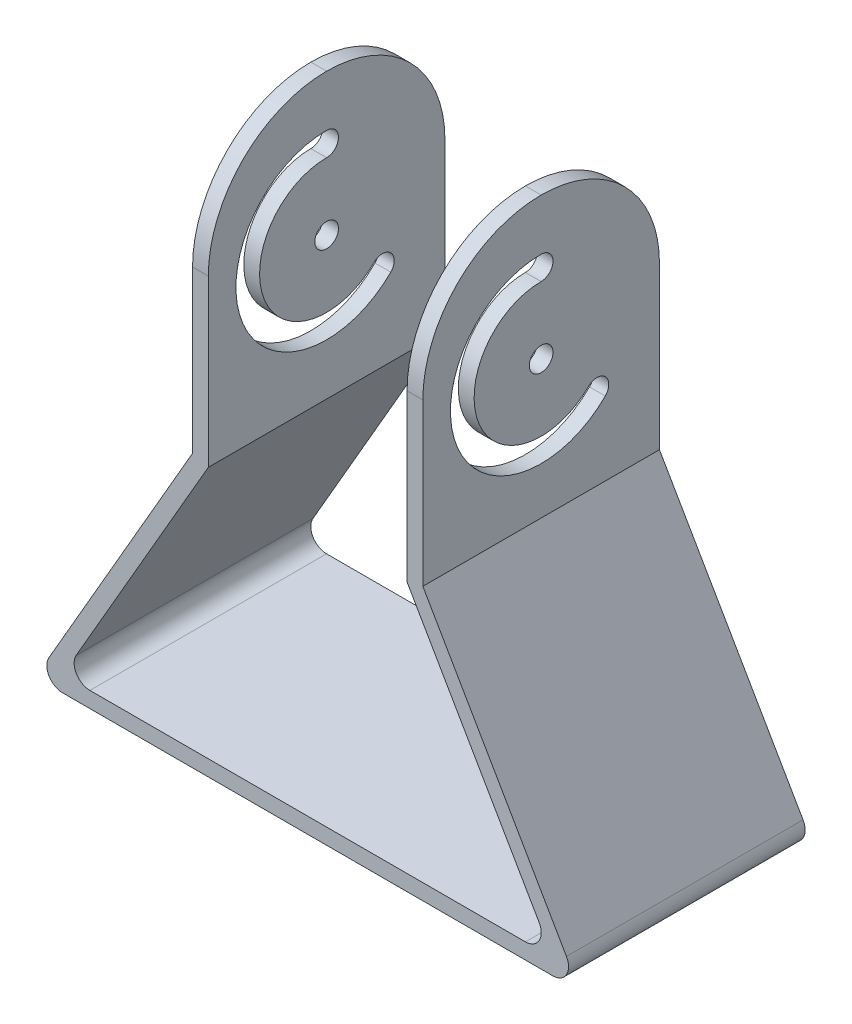
ISO-10303-21;
HEADER;
FILE_DESCRIPTION(('STEP AP214'),'2;1');
FILE_NAME('part.step','',(''),(''),'','','');
FILE_SCHEMA(('AUTOMOTIVE_DESIGN { 1 0 10303 214 1 1 1 1 }'));
ENDSEC;
DATA;
#1=APPLICATION_CONTEXT('core data for automotive mechanical design processes');
#2=APPLICATION_PROTOCOL_DEFINITION('international standard','automotive_design',2000,#1);
#3=PRODUCT_CONTEXT('',#1,'mechanical');
#4=PRODUCT('Part','Part','',(#3));
#5=PRODUCT_RELATED_PRODUCT_CATEGORY('part','',(#4));
#6=PRODUCT_DEFINITION_FORMATION('','',#4);
#7=PRODUCT_DEFINITION_CONTEXT('part definition',#1,'design');
#8=PRODUCT_DEFINITION('design','',#6,#7);
#9=PRODUCT_DEFINITION_SHAPE('','',#8);
#10=(LENGTH_UNIT() NAMED_UNIT(*) SI_UNIT(.MILLI.,.METRE.));
#11=(NAMED_UNIT(*) PLANE_ANGLE_UNIT() SI_UNIT($,.RADIAN.));
#12=(NAMED_UNIT(*) SI_UNIT($,.STERADIAN.) SOLID_ANGLE_UNIT());
#13=UNCERTAINTY_MEASURE_WITH_UNIT(LENGTH_MEASURE(1.E-05),#10,'distance_accuracy_value','');
#14=(GEOMETRIC_REPRESENTATION_CONTEXT(3) GLOBAL_UNCERTAINTY_ASSIGNED_CONTEXT((#13)) GLOBAL_UNIT_ASSIGNED_CONTEXT((#10,
#11,#12)) REPRESENTATION_CONTEXT('',''));
#15=CARTESIAN_POINT('',(0.,0.,0.));
#16=DIRECTION('',(0.,0.,1.));
#17=DIRECTION('',(1.,0.,0.));
#18=AXIS2_PLACEMENT_3D('',#15,#16,#17);
#19=CARTESIAN_POINT('',(-245.696551146028,350.,150.));
#20=DIRECTION('',(1.,0.,0.));
#21=DIRECTION('',(0.,1.,0.));
#22=AXIS2_PLACEMENT_3D('',#19,#20,#21);
#23=PLANE('',#22);
#24=CARTESIAN_POINT('',(-245.696551146028,260.,75.));
#25=DIRECTION('',(-1.,0.,0.));
#26=DIRECTION('',(0.,-1.,0.));
#27=AXIS2_PLACEMENT_3D('',#24,#25,#26);
#28=CIRCLE('',#27,57.5);
#29=CARTESIAN_POINT('',(-245.696551146028,219.341360081774,34.3413600817733));
#30=VERTEX_POINT('',#29);
#31=CARTESIAN_POINT('',(-245.696551146028,317.5,75.0000000000002));
#32=VERTEX_POINT('',#31);
#33=EDGE_CURVE('E246',#30,#32,#28,.T.);
#34=ORIENTED_EDGE('',*,*,#33,.F.);
#35=CARTESIAN_POINT('',(-245.696551146028,224.644660940673,39.6446609406724));
#36=DIRECTION('',(-1.,0.,0.));
#37=DIRECTION('',(0.,-1.,0.));
#38=AXIS2_PLACEMENT_3D('',#35,#36,#37);
#39=CIRCLE('',#38,7.5);
#40=CARTESIAN_POINT('',(-245.696551146028,229.947961799572,44.9479617995716));
#41=VERTEX_POINT('',#40);
#42=EDGE_CURVE('E221',#41,#30,#39,.T.);
#43=ORIENTED_EDGE('',*,*,#42,.F.);
#44=CARTESIAN_POINT('',(-245.696551146028,260.,75.));
#45=DIRECTION('',(1.,0.,0.));
#46=DIRECTION('',(0.,-1.,0.));
#47=AXIS2_PLACEMENT_3D('',#44,#45,#46);
#48=CIRCLE('',#47,42.5);
#49=CARTESIAN_POINT('',(-245.696551146028,302.5,75.0000000000002));
#50=VERTEX_POINT('',#49);
#51=EDGE_CURVE('E232',#50,#41,#48,.T.);
#52=ORIENTED_EDGE('',*,*,#51,.F.);
#53=CARTESIAN_POINT('',(-245.696551146028,310.,75.0000000000002));
#54=DIRECTION('',(-1.,0.,0.));
#55=DIRECTION('',(0.,-1.,0.));
#56=AXIS2_PLACEMENT_3D('',#53,#54,#55);
#57=CIRCLE('',#56,7.50000000000001);
#58=EDGE_CURVE('E240',#32,#50,#57,.T.);
#59=ORIENTED_EDGE('',*,*,#58,.F.);
#60=EDGE_LOOP('',(#34,#43,#52,#59));
#61=FACE_BOUND('',#60,.T.);
#62=CARTESIAN_POINT('',(-245.696551146028,260.,75.));
#63=DIRECTION('',(-1.,0.,0.));
#64=DIRECTION('',(0.,-1.,0.));
#65=AXIS2_PLACEMENT_3D('',#62,#63,#64);
#66=CIRCLE('',#65,7.50000000000003);
#67=CARTESIAN_POINT('',(-245.696551146028,252.5,75.));
#68=VERTEX_POINT('',#67);
#69=EDGE_CURVE('E248',#68,#68,#66,.T.);
#70=ORIENTED_EDGE('',*,*,#69,.F.);
#71=EDGE_LOOP('',(#70));
#72=FACE_BOUND('',#71,.T.);
#73=DIRECTION('',(0.,-1.,0.));
#74=VECTOR('',#73,1.);
#75=CARTESIAN_POINT('',(-245.696551146028,350.,150.));
#76=LINE('',#75,#74);
#77=CARTESIAN_POINT('',(-245.696551146028,275.,150.));
#78=VERTEX_POINT('',#77);
#79=CARTESIAN_POINT('',(-245.696551146028,172.679491924311,150.));
#80=VERTEX_POINT('',#79);
#81=EDGE_CURVE('E299',#78,#80,#76,.T.);
#82=ORIENTED_EDGE('',*,*,#81,.F.);
#83=CARTESIAN_POINT('',(-245.696551146028,275.,75.));
#84=DIRECTION('',(1.,0.,0.));
#85=DIRECTION('',(0.,1.,0.));
#86=AXIS2_PLACEMENT_3D('',#83,#84,#85);
#87=CIRCLE('',#86,75.);
#88=CARTESIAN_POINT('',(-245.696551146028,350.,75.));
#89=VERTEX_POINT('',#88);
#90=EDGE_CURVE('E428',#78,#89,#87,.F.);
#91=ORIENTED_EDGE('',*,*,#90,.T.);
#92=CARTESIAN_POINT('',(-245.696551146028,275.,75.));
#93=DIRECTION('',(1.,0.,0.));
#94=DIRECTION('',(0.,1.,0.));
#95=AXIS2_PLACEMENT_3D('',#92,#93,#94);
#96=CIRCLE('',#95,75.);
#97=CARTESIAN_POINT('',(-245.696551146028,275.,0.));
#98=VERTEX_POINT('',#97);
#99=EDGE_CURVE('E425',#89,#98,#96,.F.);
#100=ORIENTED_EDGE('',*,*,#99,.T.);
#101=DIRECTION('',(0.,-1.,0.));
#102=VECTOR('',#101,1.);
#103=CARTESIAN_POINT('',(-245.696551146028,350.,0.));
#104=LINE('',#103,#102);
#105=CARTESIAN_POINT('',(-245.696551146028,172.679491924311,0.));
#106=VERTEX_POINT('',#105);
#107=EDGE_CURVE('E298',#98,#106,#104,.T.);
#108=ORIENTED_EDGE('',*,*,#107,.T.);
#109=DIRECTION('',(0.,0.,-1.));
#110=VECTOR('',#109,1.);
#111=CARTESIAN_POINT('',(-245.696551146028,172.679491924311,150.));
#112=LINE('',#111,#110);
#113=EDGE_CURVE('E379',#80,#106,#112,.T.);
#114=ORIENTED_EDGE('',*,*,#113,.F.);
#115=EDGE_LOOP('',(#82,#91,#100,#108,#114));
#116=FACE_BOUND('',#115,.T.);
#117=ADVANCED_FACE('F42',(#61,#72,#116),#23,.F.);
#118=CARTESIAN_POINT('',(-245.696551146028,172.679491924311,150.));
#119=DIRECTION('',(0.866025403784436,-0.500000000000004,0.));
#120=DIRECTION('',(0.500000000000004,0.866025403784436,0.));
#121=AXIS2_PLACEMENT_3D('',#118,#119,#120);
#122=PLANE('',#121);
#123=DIRECTION('',(-0.500000000000004,-0.866025403784436,0.));
#124=VECTOR('',#123,1.);
#125=CARTESIAN_POINT('',(-245.696551146028,172.679491924311,0.));
#126=LINE('',#125,#124);
#127=CARTESIAN_POINT('',(-336.732848254214,15.,0.));
#128=VERTEX_POINT('',#127);
#129=EDGE_CURVE('E337',#106,#128,#126,.T.);
#130=ORIENTED_EDGE('',*,*,#129,.T.);
#131=DIRECTION('',(0.,0.,-1.));
#132=VECTOR('',#131,1.);
#133=CARTESIAN_POINT('',(-336.732848254214,15.0000000000001,150.));
#134=LINE('',#133,#132);
#135=CARTESIAN_POINT('',(-336.732848254214,15.,150.));
#136=VERTEX_POINT('',#135);
#137=EDGE_CURVE('E58',#128,#136,#134,.F.);
#138=ORIENTED_EDGE('',*,*,#137,.T.);
#139=DIRECTION('',(-0.500000000000004,-0.866025403784436,0.));
#140=VECTOR('',#139,1.);
#141=CARTESIAN_POINT('',(-245.696551146028,172.679491924311,150.));
#142=LINE('',#141,#140);
#143=EDGE_CURVE('E302',#80,#136,#142,.T.);
#144=ORIENTED_EDGE('',*,*,#143,.F.);
#145=ORIENTED_EDGE('',*,*,#113,.T.);
#146=EDGE_LOOP('',(#130,#138,#144,#145));
#147=FACE_BOUND('',#146,.T.);
#148=ADVANCED_FACE('F539',(#147),#122,.F.);
#149=CARTESIAN_POINT('',(-345.393102292058,0.,150.));
#150=DIRECTION('',(0.,1.,0.));
#151=DIRECTION('',(0.,0.,1.));
#152=AXIS2_PLACEMENT_3D('',#149,#150,#151);
#153=PLANE('',#152);
#154=DIRECTION('',(1.,0.,0.));
#155=VECTOR('',#154,1.);
#156=CARTESIAN_POINT('',(-345.393102292058,0.,0.));
#157=LINE('',#156,#155);
#158=CARTESIAN_POINT('',(-328.07259421637,0.,0.));
#159=VERTEX_POINT('',#158);
#160=CARTESIAN_POINT('',(-17.3205080756887,0.,0.));
#161=VERTEX_POINT('',#160);
#162=EDGE_CURVE('E340',#159,#161,#157,.T.);
#163=ORIENTED_EDGE('',*,*,#162,.T.);
#164=DIRECTION('',(0.,0.,-1.));
#165=VECTOR('',#164,1.);
#166=CARTESIAN_POINT('',(-17.3205080756887,0.,150.));
#167=LINE('',#166,#165);
#168=CARTESIAN_POINT('',(-17.3205080756887,0.,150.));
#169=VERTEX_POINT('',#168);
#170=EDGE_CURVE('E468',#161,#169,#167,.F.);
#171=ORIENTED_EDGE('',*,*,#170,.T.);
#172=DIRECTION('',(1.,0.,0.));
#173=VECTOR('',#172,1.);
#174=CARTESIAN_POINT('',(-345.393102292058,0.,150.));
#175=LINE('',#174,#173);
#176=CARTESIAN_POINT('',(-328.07259421637,0.,150.));
#177=VERTEX_POINT('',#176);
#178=EDGE_CURVE('E306',#177,#169,#175,.T.);
#179=ORIENTED_EDGE('',*,*,#178,.F.);
#180=DIRECTION('',(0.,0.,-1.));
#181=VECTOR('',#180,1.);
#182=CARTESIAN_POINT('',(-328.07259421637,0.,150.));
#183=LINE('',#182,#181);
#184=EDGE_CURVE('E464',#177,#159,#183,.T.);
#185=ORIENTED_EDGE('',*,*,#184,.T.);
#186=EDGE_LOOP('',(#163,#171,#179,#185));
#187=FACE_BOUND('',#186,.T.);
#188=ADVANCED_FACE('F546',(#187),#153,.F.);
#189=CARTESIAN_POINT('',(-99.6965511460284,172.679491924311,150.));
#190=DIRECTION('',(-0.86602540378444,-0.499999999999998,0.));
#191=DIRECTION('',(0.499999999999998,-0.86602540378444,0.));
#192=AXIS2_PLACEMENT_3D('',#189,#190,#191);
#193=PLANE('',#192);
#194=DIRECTION('',(-0.499999999999998,0.86602540378444,0.));
#195=VECTOR('',#194,1.);
#196=CARTESIAN_POINT('',(-99.6965511460284,172.679491924311,150.));
#197=LINE('',#196,#195);
#198=CARTESIAN_POINT('',(-8.66025403784434,15.,150.));
#199=VERTEX_POINT('',#198);
#200=CARTESIAN_POINT('',(-99.6965511460284,172.679491924311,150.));
#201=VERTEX_POINT('',#200);
#202=EDGE_CURVE('E310',#199,#201,#197,.T.);
#203=ORIENTED_EDGE('',*,*,#202,.F.);
#204=DIRECTION('',(0.,0.,-1.));
#205=VECTOR('',#204,1.);
#206=CARTESIAN_POINT('',(-8.66025403784434,15.,150.));
#207=LINE('',#206,#205);
#208=CARTESIAN_POINT('',(-8.66025403784434,15.,0.));
#209=VERTEX_POINT('',#208);
#210=EDGE_CURVE('E454',#199,#209,#207,.T.);
#211=ORIENTED_EDGE('',*,*,#210,.T.);
#212=DIRECTION('',(-0.499999999999998,0.86602540378444,0.));
#213=VECTOR('',#212,1.);
#214=CARTESIAN_POINT('',(-99.6965511460284,172.679491924311,0.));
#215=LINE('',#214,#213);
#216=CARTESIAN_POINT('',(-99.6965511460284,172.679491924311,0.));
#217=VERTEX_POINT('',#216);
#218=EDGE_CURVE('E344',#209,#217,#215,.T.);
#219=ORIENTED_EDGE('',*,*,#218,.T.);
#220=DIRECTION('',(0.,0.,-1.));
#221=VECTOR('',#220,1.);
#222=CARTESIAN_POINT('',(-99.6965511460284,172.679491924311,150.));
#223=LINE('',#222,#221);
#224=EDGE_CURVE('E375',#201,#217,#223,.T.);
#225=ORIENTED_EDGE('',*,*,#224,.F.);
#226=EDGE_LOOP('',(#203,#211,#219,#225));
#227=FACE_BOUND('',#226,.T.);
#228=ADVANCED_FACE('F588',(#227),#193,.F.);
#229=CARTESIAN_POINT('',(-99.6965511460284,172.679491924311,150.));
#230=DIRECTION('',(-1.,0.,0.));
#231=DIRECTION('',(0.,0.,1.));
#232=AXIS2_PLACEMENT_3D('',#229,#230,#231);
#233=PLANE('',#232);
#234=CARTESIAN_POINT('',(-99.6965511460284,260.,75.));
#235=DIRECTION('',(1.,0.,0.));
#236=DIRECTION('',(0.,-1.,0.));
#237=AXIS2_PLACEMENT_3D('',#234,#235,#236);
#238=CIRCLE('',#237,42.5);
#239=CARTESIAN_POINT('',(-99.6965511460284,302.5,75.0000000000002));
#240=VERTEX_POINT('',#239);
#241=CARTESIAN_POINT('',(-99.6965511460284,229.947961799572,44.9479617995716));
#242=VERTEX_POINT('',#241);
#243=EDGE_CURVE('E258',#240,#242,#238,.T.);
#244=ORIENTED_EDGE('',*,*,#243,.T.);
#245=CARTESIAN_POINT('',(-99.6965511460284,224.644660940673,39.6446609406724));
#246=DIRECTION('',(-1.,0.,0.));
#247=DIRECTION('',(0.,-1.,0.));
#248=AXIS2_PLACEMENT_3D('',#245,#246,#247);
#249=CIRCLE('',#248,7.5);
#250=CARTESIAN_POINT('',(-99.6965511460284,219.341360081774,34.3413600817733));
#251=VERTEX_POINT('',#250);
#252=EDGE_CURVE('E241',#242,#251,#249,.T.);
#253=ORIENTED_EDGE('',*,*,#252,.T.);
#254=CARTESIAN_POINT('',(-99.6965511460284,260.,75.));
#255=DIRECTION('',(-1.,0.,0.));
#256=DIRECTION('',(0.,-1.,0.));
#257=AXIS2_PLACEMENT_3D('',#254,#255,#256);
#258=CIRCLE('',#257,57.5);
#259=CARTESIAN_POINT('',(-99.6965511460284,317.5,75.0000000000002));
#260=VERTEX_POINT('',#259);
#261=EDGE_CURVE('E267',#251,#260,#258,.T.);
#262=ORIENTED_EDGE('',*,*,#261,.T.);
#263=CARTESIAN_POINT('',(-99.6965511460284,310.,75.0000000000002));
#264=DIRECTION('',(-1.,0.,0.));
#265=DIRECTION('',(0.,-1.,0.));
#266=AXIS2_PLACEMENT_3D('',#263,#264,#265);
#267=CIRCLE('',#266,7.50000000000001);
#268=EDGE_CURVE('E262',#260,#240,#267,.T.);
#269=ORIENTED_EDGE('',*,*,#268,.T.);
#270=EDGE_LOOP('',(#244,#253,#262,#269));
#271=FACE_BOUND('',#270,.T.);
#272=CARTESIAN_POINT('',(-99.6965511460284,260.,75.));
#273=DIRECTION('',(-1.,0.,0.));
#274=DIRECTION('',(0.,-1.,0.));
#275=AXIS2_PLACEMENT_3D('',#272,#273,#274);
#276=CIRCLE('',#275,7.50000000000003);
#277=CARTESIAN_POINT('',(-99.6965511460284,252.5,75.));
#278=VERTEX_POINT('',#277);
#279=EDGE_CURVE('E253',#278,#278,#276,.T.);
#280=ORIENTED_EDGE('',*,*,#279,.T.);
#281=EDGE_LOOP('',(#280));
#282=FACE_BOUND('',#281,.T.);
#283=DIRECTION('',(0.,1.,0.));
#284=VECTOR('',#283,1.);
#285=CARTESIAN_POINT('',(-99.6965511460284,172.679491924311,0.));
#286=LINE('',#285,#284);
#287=CARTESIAN_POINT('',(-99.6965511460284,275.,0.));
#288=VERTEX_POINT('',#287);
#289=EDGE_CURVE('E347',#217,#288,#286,.T.);
#290=ORIENTED_EDGE('',*,*,#289,.T.);
#291=CARTESIAN_POINT('',(-99.6965511460284,275.,75.));
#292=DIRECTION('',(-1.,0.,0.));
#293=DIRECTION('',(0.,0.,1.));
#294=AXIS2_PLACEMENT_3D('',#291,#292,#293);
#295=CIRCLE('',#294,75.);
#296=CARTESIAN_POINT('',(-99.6965511460284,350.,75.));
#297=VERTEX_POINT('',#296);
#298=EDGE_CURVE('E415',#288,#297,#295,.F.);
#299=ORIENTED_EDGE('',*,*,#298,.T.);
#300=CARTESIAN_POINT('',(-99.6965511460284,275.,75.));
#301=DIRECTION('',(-1.,0.,0.));
#302=DIRECTION('',(0.,0.,1.));
#303=AXIS2_PLACEMENT_3D('',#300,#301,#302);
#304=CIRCLE('',#303,75.);
#305=CARTESIAN_POINT('',(-99.6965511460284,275.,150.));
#306=VERTEX_POINT('',#305);
#307=EDGE_CURVE('E412',#297,#306,#304,.F.);
#308=ORIENTED_EDGE('',*,*,#307,.T.);
#309=DIRECTION('',(0.,1.,0.));
#310=VECTOR('',#309,1.);
#311=CARTESIAN_POINT('',(-99.6965511460284,172.679491924311,150.));
#312=LINE('',#311,#310);
#313=EDGE_CURVE('E313',#201,#306,#312,.T.);
#314=ORIENTED_EDGE('',*,*,#313,.F.);
#315=ORIENTED_EDGE('',*,*,#224,.T.);
#316=EDGE_LOOP('',(#290,#299,#308,#314,#315));
#317=FACE_BOUND('',#316,.T.);
#318=ADVANCED_FACE('F592',(#271,#282,#317),#233,.F.);
#319=CARTESIAN_POINT('',(-109.696551146028,350.,150.));
#320=DIRECTION('',(1.,0.,0.));
#321=DIRECTION('',(0.,1.,0.));
#322=AXIS2_PLACEMENT_3D('',#319,#320,#321);
#323=PLANE('',#322);
#324=CARTESIAN_POINT('',(-109.696551146028,260.,75.));
#325=DIRECTION('',(1.,0.,0.));
#326=DIRECTION('',(0.,1.,0.));
#327=AXIS2_PLACEMENT_3D('',#324,#325,#326);
#328=CIRCLE('',#327,57.5);
#329=CARTESIAN_POINT('',(-109.696551146028,317.5,75.0000000000002));
#330=VERTEX_POINT('',#329);
#331=CARTESIAN_POINT('',(-109.696551146028,219.341360081774,34.3413600817733));
#332=VERTEX_POINT('',#331);
#333=EDGE_CURVE('E282',#330,#332,#328,.T.);
#334=ORIENTED_EDGE('',*,*,#333,.T.);
#335=CARTESIAN_POINT('',(-109.696551146028,224.644660940673,39.6446609406724));
#336=DIRECTION('',(1.,0.,0.));
#337=DIRECTION('',(0.,1.,0.));
#338=AXIS2_PLACEMENT_3D('',#335,#336,#337);
#339=CIRCLE('',#338,7.5);
#340=CARTESIAN_POINT('',(-109.696551146028,229.947961799572,44.9479617995716));
#341=VERTEX_POINT('',#340);
#342=EDGE_CURVE('E294',#332,#341,#339,.T.);
#343=ORIENTED_EDGE('',*,*,#342,.T.);
#344=CARTESIAN_POINT('',(-109.696551146028,260.,75.));
#345=DIRECTION('',(1.,0.,0.));
#346=DIRECTION('',(0.,1.,0.));
#347=AXIS2_PLACEMENT_3D('',#344,#345,#346);
#348=CIRCLE('',#347,42.5);
#349=CARTESIAN_POINT('',(-109.696551146028,302.5,75.0000000000002));
#350=VERTEX_POINT('',#349);
#351=EDGE_CURVE('E290',#341,#350,#348,.F.);
#352=ORIENTED_EDGE('',*,*,#351,.T.);
#353=CARTESIAN_POINT('',(-109.696551146028,310.,75.0000000000002));
#354=DIRECTION('',(1.,0.,0.));
#355=DIRECTION('',(0.,1.,0.));
#356=AXIS2_PLACEMENT_3D('',#353,#354,#355);
#357=CIRCLE('',#356,7.50000000000001);
#358=EDGE_CURVE('E286',#350,#330,#357,.T.);
#359=ORIENTED_EDGE('',*,*,#358,.T.);
#360=EDGE_LOOP('',(#334,#343,#352,#359));
#361=FACE_BOUND('',#360,.T.);
#362=CARTESIAN_POINT('',(-109.696551146028,260.,75.));
#363=DIRECTION('',(1.,0.,0.));
#364=DIRECTION('',(0.,1.,0.));
#365=AXIS2_PLACEMENT_3D('',#362,#363,#364);
#366=CIRCLE('',#365,7.50000000000003);
#367=CARTESIAN_POINT('',(-109.696551146028,267.5,75.));
#368=VERTEX_POINT('',#367);
#369=EDGE_CURVE('E278',#368,#368,#366,.T.);
#370=ORIENTED_EDGE('',*,*,#369,.T.);
#371=EDGE_LOOP('',(#370));
#372=FACE_BOUND('',#371,.T.);
#373=CARTESIAN_POINT('',(-109.696551146028,275.,75.));
#374=DIRECTION('',(1.,0.,0.));
#375=DIRECTION('',(0.,1.,0.));
#376=AXIS2_PLACEMENT_3D('',#373,#374,#375);
#377=CIRCLE('',#376,75.);
#378=CARTESIAN_POINT('',(-109.696551146028,275.,150.));
#379=VERTEX_POINT('',#378);
#380=CARTESIAN_POINT('',(-109.696551146028,350.,75.));
#381=VERTEX_POINT('',#380);
#382=EDGE_CURVE('E399',#379,#381,#377,.F.);
#383=ORIENTED_EDGE('',*,*,#382,.T.);
#384=CARTESIAN_POINT('',(-109.696551146028,275.,75.));
#385=DIRECTION('',(1.,0.,0.));
#386=DIRECTION('',(0.,1.,0.));
#387=AXIS2_PLACEMENT_3D('',#384,#385,#386);
#388=CIRCLE('',#387,75.);
#389=CARTESIAN_POINT('',(-109.696551146028,275.,0.));
#390=VERTEX_POINT('',#389);
#391=EDGE_CURVE('E402',#381,#390,#388,.F.);
#392=ORIENTED_EDGE('',*,*,#391,.T.);
#393=DIRECTION('',(0.,-1.,0.));
#394=VECTOR('',#393,1.);
#395=CARTESIAN_POINT('',(-109.696551146028,350.,0.));
#396=LINE('',#395,#394);
#397=CARTESIAN_POINT('',(-109.696551146028,170.,0.));
#398=VERTEX_POINT('',#397);
#399=EDGE_CURVE('E351',#390,#398,#396,.T.);
#400=ORIENTED_EDGE('',*,*,#399,.T.);
#401=DIRECTION('',(0.,0.,-1.));
#402=VECTOR('',#401,1.);
#403=CARTESIAN_POINT('',(-109.696551146028,170.,150.));
#404=LINE('',#403,#402);
#405=CARTESIAN_POINT('',(-109.696551146028,170.,150.));
#406=VERTEX_POINT('',#405);
#407=EDGE_CURVE('E371',#406,#398,#404,.T.);
#408=ORIENTED_EDGE('',*,*,#407,.F.);
#409=DIRECTION('',(0.,-1.,0.));
#410=VECTOR('',#409,1.);
#411=CARTESIAN_POINT('',(-109.696551146028,350.,150.));
#412=LINE('',#411,#410);
#413=EDGE_CURVE('E317',#379,#406,#412,.T.);
#414=ORIENTED_EDGE('',*,*,#413,.F.);
#415=EDGE_LOOP('',(#383,#392,#400,#408,#414));
#416=FACE_BOUND('',#415,.T.);
#417=ADVANCED_FACE('F600',(#361,#372,#416),#323,.F.);
#418=CARTESIAN_POINT('',(-109.696551146028,170.,150.));
#419=DIRECTION('',(0.86602540378444,0.499999999999998,0.));
#420=DIRECTION('',(-0.499999999999998,0.86602540378444,0.));
#421=AXIS2_PLACEMENT_3D('',#418,#419,#420);
#422=PLANE('',#421);
#423=DIRECTION('',(0.499999999999998,-0.86602540378444,0.));
#424=VECTOR('',#423,1.);
#425=CARTESIAN_POINT('',(-109.696551146028,170.,0.));
#426=LINE('',#425,#424);
#427=CARTESIAN_POINT('',(-25.980762113533,24.9999999999999,0.));
#428=VERTEX_POINT('',#427);
#429=EDGE_CURVE('E354',#398,#428,#426,.T.);
#430=ORIENTED_EDGE('',*,*,#429,.T.);
#431=DIRECTION('',(0.,0.,-1.));
#432=VECTOR('',#431,1.);
#433=CARTESIAN_POINT('',(-25.980762113533,24.9999999999999,150.));
#434=LINE('',#433,#432);
#435=CARTESIAN_POINT('',(-25.980762113533,24.9999999999999,150.));
#436=VERTEX_POINT('',#435);
#437=EDGE_CURVE('E451',#428,#436,#434,.F.);
#438=ORIENTED_EDGE('',*,*,#437,.T.);
#439=DIRECTION('',(0.499999999999998,-0.86602540378444,0.));
#440=VECTOR('',#439,1.);
#441=CARTESIAN_POINT('',(-109.696551146028,170.,150.));
#442=LINE('',#441,#440);
#443=EDGE_CURVE('E320',#406,#436,#442,.T.);
#444=ORIENTED_EDGE('',*,*,#443,.F.);
#445=ORIENTED_EDGE('',*,*,#407,.T.);
#446=EDGE_LOOP('',(#430,#438,#444,#445));
#447=FACE_BOUND('',#446,.T.);
#448=ADVANCED_FACE('F608',(#447),#422,.F.);
#449=CARTESIAN_POINT('',(-328.07259421637,9.9999999999999,150.));
#450=DIRECTION('',(0.,-1.,0.));
#451=DIRECTION('',(0.,0.,-1.));
#452=AXIS2_PLACEMENT_3D('',#449,#450,#451);
#453=PLANE('',#452);
#454=DIRECTION('',(-1.,0.,0.));
#455=VECTOR('',#454,1.);
#456=CARTESIAN_POINT('',(-328.07259421637,9.9999999999999,150.));
#457=LINE('',#456,#455);
#458=CARTESIAN_POINT('',(-34.6410161513773,9.9999999999999,150.));
#459=VERTEX_POINT('',#458);
#460=CARTESIAN_POINT('',(-310.752086140681,9.9999999999999,150.));
#461=VERTEX_POINT('',#460);
#462=EDGE_CURVE('E324',#459,#461,#457,.T.);
#463=ORIENTED_EDGE('',*,*,#462,.F.);
#464=DIRECTION('',(0.,0.,-1.));
#465=VECTOR('',#464,1.);
#466=CARTESIAN_POINT('',(-34.6410161513773,9.9999999999999,0.));
#467=LINE('',#466,#465);
#468=CARTESIAN_POINT('',(-34.6410161513773,9.9999999999999,0.));
#469=VERTEX_POINT('',#468);
#470=EDGE_CURVE('E447',#459,#469,#467,.T.);
#471=ORIENTED_EDGE('',*,*,#470,.T.);
#472=DIRECTION('',(-1.,0.,0.));
#473=VECTOR('',#472,1.);
#474=CARTESIAN_POINT('',(-328.07259421637,9.9999999999999,0.));
#475=LINE('',#474,#473);
#476=CARTESIAN_POINT('',(-310.752086140681,9.9999999999999,0.));
#477=VERTEX_POINT('',#476);
#478=EDGE_CURVE('E358',#469,#477,#475,.T.);
#479=ORIENTED_EDGE('',*,*,#478,.T.);
#480=DIRECTION('',(0.,0.,-1.));
#481=VECTOR('',#480,1.);
#482=CARTESIAN_POINT('',(-310.752086140681,9.9999999999999,150.));
#483=LINE('',#482,#481);
#484=EDGE_CURVE('E437',#477,#461,#483,.F.);
#485=ORIENTED_EDGE('',*,*,#484,.T.);
#486=EDGE_LOOP('',(#463,#471,#479,#485));
#487=FACE_BOUND('',#486,.T.);
#488=ADVANCED_FACE('F500',(#487),#453,.F.);
#489=CARTESIAN_POINT('',(-235.696551146028,170.,150.));
#490=DIRECTION('',(-0.866025403784436,0.500000000000004,0.));
#491=DIRECTION('',(-0.500000000000004,-0.866025403784436,0.));
#492=AXIS2_PLACEMENT_3D('',#489,#490,#491);
#493=PLANE('',#492);
#494=DIRECTION('',(0.500000000000004,0.866025403784436,0.));
#495=VECTOR('',#494,1.);
#496=CARTESIAN_POINT('',(-235.696551146028,170.,150.));
#497=LINE('',#496,#495);
#498=CARTESIAN_POINT('',(-319.412340178525,24.9999999999999,150.));
#499=VERTEX_POINT('',#498);
#500=CARTESIAN_POINT('',(-235.696551146028,170.,150.));
#501=VERTEX_POINT('',#500);
#502=EDGE_CURVE('E327',#499,#501,#497,.T.);
#503=ORIENTED_EDGE('',*,*,#502,.F.);
#504=DIRECTION('',(0.,0.,-1.));
#505=VECTOR('',#504,1.);
#506=CARTESIAN_POINT('',(-319.412340178525,24.9999999999999,0.));
#507=LINE('',#506,#505);
#508=CARTESIAN_POINT('',(-319.412340178525,24.9999999999999,0.));
#509=VERTEX_POINT('',#508);
#510=EDGE_CURVE('E477',#499,#509,#507,.T.);
#511=ORIENTED_EDGE('',*,*,#510,.T.);
#512=DIRECTION('',(0.500000000000004,0.866025403784436,0.));
#513=VECTOR('',#512,1.);
#514=CARTESIAN_POINT('',(-235.696551146028,170.,0.));
#515=LINE('',#514,#513);
#516=CARTESIAN_POINT('',(-235.696551146028,170.,0.));
#517=VERTEX_POINT('',#516);
#518=EDGE_CURVE('E362',#509,#517,#515,.T.);
#519=ORIENTED_EDGE('',*,*,#518,.T.);
#520=DIRECTION('',(0.,0.,-1.));
#521=VECTOR('',#520,1.);
#522=CARTESIAN_POINT('',(-235.696551146028,170.,150.));
#523=LINE('',#522,#521);
#524=EDGE_CURVE('E334',#501,#517,#523,.T.);
#525=ORIENTED_EDGE('',*,*,#524,.F.);
#526=EDGE_LOOP('',(#503,#511,#519,#525));
#527=FACE_BOUND('',#526,.T.);
#528=ADVANCED_FACE('F504',(#527),#493,.F.);
#529=CARTESIAN_POINT('',(-235.696551146028,350.,150.));
#530=DIRECTION('',(-1.,0.,0.));
#531=DIRECTION('',(0.,0.,1.));
#532=AXIS2_PLACEMENT_3D('',#529,#530,#531);
#533=PLANE('',#532);
#534=CARTESIAN_POINT('',(-235.696551146028,260.,75.));
#535=DIRECTION('',(-1.,0.,0.));
#536=DIRECTION('',(0.,0.,1.));
#537=AXIS2_PLACEMENT_3D('',#534,#535,#536);
#538=CIRCLE('',#537,42.5);
#539=CARTESIAN_POINT('',(-235.696551146028,302.5,75.0000000000002));
#540=VERTEX_POINT('',#539);
#541=CARTESIAN_POINT('',(-235.696551146028,229.947961799572,44.9479617995716));
#542=VERTEX_POINT('',#541);
#543=EDGE_CURVE('E394',#540,#542,#538,.F.);
#544=ORIENTED_EDGE('',*,*,#543,.T.);
#545=CARTESIAN_POINT('',(-235.696551146028,224.644660940673,39.6446609406724));
#546=DIRECTION('',(-1.,0.,0.));
#547=DIRECTION('',(0.,0.,1.));
#548=AXIS2_PLACEMENT_3D('',#545,#546,#547);
#549=CIRCLE('',#548,7.5);
#550=CARTESIAN_POINT('',(-235.696551146028,219.341360081774,34.3413600817733));
#551=VERTEX_POINT('',#550);
#552=EDGE_CURVE('E224',#542,#551,#549,.T.);
#553=ORIENTED_EDGE('',*,*,#552,.T.);
#554=CARTESIAN_POINT('',(-235.696551146028,260.,75.));
#555=DIRECTION('',(-1.,0.,0.));
#556=DIRECTION('',(0.,0.,1.));
#557=AXIS2_PLACEMENT_3D('',#554,#555,#556);
#558=CIRCLE('',#557,57.5);
#559=CARTESIAN_POINT('',(-235.696551146028,317.5,75.0000000000002));
#560=VERTEX_POINT('',#559);
#561=EDGE_CURVE('E383',#551,#560,#558,.T.);
#562=ORIENTED_EDGE('',*,*,#561,.T.);
#563=CARTESIAN_POINT('',(-235.696551146028,310.,75.0000000000002));
#564=DIRECTION('',(-1.,0.,0.));
#565=DIRECTION('',(0.,0.,1.));
#566=AXIS2_PLACEMENT_3D('',#563,#564,#565);
#567=CIRCLE('',#566,7.50000000000001);
#568=EDGE_CURVE('E390',#560,#540,#567,.T.);
#569=ORIENTED_EDGE('',*,*,#568,.T.);
#570=EDGE_LOOP('',(#544,#553,#562,#569));
#571=FACE_BOUND('',#570,.T.);
#572=CARTESIAN_POINT('',(-235.696551146028,260.,75.));
#573=DIRECTION('',(-1.,0.,0.));
#574=DIRECTION('',(0.,0.,1.));
#575=AXIS2_PLACEMENT_3D('',#572,#573,#574);
#576=CIRCLE('',#575,7.50000000000003);
#577=CARTESIAN_POINT('',(-235.696551146028,260.,82.5));
#578=VERTEX_POINT('',#577);
#579=EDGE_CURVE('E276',#578,#578,#576,.T.);
#580=ORIENTED_EDGE('',*,*,#579,.T.);
#581=EDGE_LOOP('',(#580));
#582=FACE_BOUND('',#581,.T.);
#583=CARTESIAN_POINT('',(-235.696551146028,275.,75.));
#584=DIRECTION('',(-1.,0.,0.));
#585=DIRECTION('',(0.,0.,1.));
#586=AXIS2_PLACEMENT_3D('',#583,#584,#585);
#587=CIRCLE('',#586,75.);
#588=CARTESIAN_POINT('',(-235.696551146028,275.,0.));
#589=VERTEX_POINT('',#588);
#590=CARTESIAN_POINT('',(-235.696551146028,350.,75.));
#591=VERTEX_POINT('',#590);
#592=EDGE_CURVE('E431',#589,#591,#587,.F.);
#593=ORIENTED_EDGE('',*,*,#592,.T.);
#594=CARTESIAN_POINT('',(-235.696551146028,275.,75.));
#595=DIRECTION('',(-1.,0.,0.));
#596=DIRECTION('',(0.,0.,1.));
#597=AXIS2_PLACEMENT_3D('',#594,#595,#596);
#598=CIRCLE('',#597,75.);
#599=CARTESIAN_POINT('',(-235.696551146028,275.,150.));
#600=VERTEX_POINT('',#599);
#601=EDGE_CURVE('E434',#591,#600,#598,.F.);
#602=ORIENTED_EDGE('',*,*,#601,.T.);
#603=DIRECTION('',(0.,1.,0.));
#604=VECTOR('',#603,1.);
#605=CARTESIAN_POINT('',(-235.696551146028,350.,150.));
#606=LINE('',#605,#604);
#607=EDGE_CURVE('E330',#501,#600,#606,.T.);
#608=ORIENTED_EDGE('',*,*,#607,.F.);
#609=ORIENTED_EDGE('',*,*,#524,.T.);
#610=DIRECTION('',(0.,1.,0.));
#611=VECTOR('',#610,1.);
#612=CARTESIAN_POINT('',(-235.696551146028,350.,0.));
#613=LINE('',#612,#611);
#614=EDGE_CURVE('E303',#517,#589,#613,.T.);
#615=ORIENTED_EDGE('',*,*,#614,.T.);
#616=EDGE_LOOP('',(#593,#602,#608,#609,#615));
#617=FACE_BOUND('',#616,.T.);
#618=ADVANCED_FACE('F524',(#571,#582,#617),#533,.F.);
#619=CARTESIAN_POINT('',(0.,0.,150.));
#620=DIRECTION('',(0.,0.,1.));
#621=DIRECTION('',(1.,0.,0.));
#622=AXIS2_PLACEMENT_3D('',#619,#620,#621);
#623=PLANE('',#622);
#624=ORIENTED_EDGE('',*,*,#178,.T.);
#625=CARTESIAN_POINT('',(-17.3205080756887,10.,150.));
#626=DIRECTION('',(0.,0.,1.));
#627=DIRECTION('',(1.,0.,0.));
#628=AXIS2_PLACEMENT_3D('',#625,#626,#627);
#629=CIRCLE('',#628,10.);
#630=EDGE_CURVE('E474',#169,#199,#629,.T.);
#631=ORIENTED_EDGE('',*,*,#630,.T.);
#632=ORIENTED_EDGE('',*,*,#202,.T.);
#633=ORIENTED_EDGE('',*,*,#313,.T.);
#634=DIRECTION('',(-1.,0.,0.));
#635=VECTOR('',#634,1.);
#636=CARTESIAN_POINT('',(-109.696551146029,275.,150.));
#637=LINE('',#636,#635);
#638=EDGE_CURVE('E422',#306,#379,#637,.T.);
#639=ORIENTED_EDGE('',*,*,#638,.T.);
#640=ORIENTED_EDGE('',*,*,#413,.T.);
#641=ORIENTED_EDGE('',*,*,#443,.T.);
#642=CARTESIAN_POINT('',(-34.6410161513773,19.9999999999999,150.));
#643=DIRECTION('',(0.,0.,1.));
#644=DIRECTION('',(1.,0.,0.));
#645=AXIS2_PLACEMENT_3D('',#642,#643,#644);
#646=CIRCLE('',#645,10.);
#647=EDGE_CURVE('E486',#436,#459,#646,.F.);
#648=ORIENTED_EDGE('',*,*,#647,.T.);
#649=ORIENTED_EDGE('',*,*,#462,.T.);
#650=CARTESIAN_POINT('',(-310.752086140681,19.9999999999999,150.));
#651=DIRECTION('',(0.,0.,1.));
#652=DIRECTION('',(1.,0.,0.));
#653=AXIS2_PLACEMENT_3D('',#650,#651,#652);
#654=CIRCLE('',#653,10.);
#655=EDGE_CURVE('E11',#461,#499,#654,.F.);
#656=ORIENTED_EDGE('',*,*,#655,.T.);
#657=ORIENTED_EDGE('',*,*,#502,.T.);
#658=ORIENTED_EDGE('',*,*,#607,.T.);
#659=DIRECTION('',(-1.,0.,0.));
#660=VECTOR('',#659,1.);
#661=CARTESIAN_POINT('',(-245.696551146028,275.,150.));
#662=LINE('',#661,#660);
#663=EDGE_CURVE('E418',#600,#78,#662,.T.);
#664=ORIENTED_EDGE('',*,*,#663,.T.);
#665=ORIENTED_EDGE('',*,*,#81,.T.);
#666=ORIENTED_EDGE('',*,*,#143,.T.);
#667=CARTESIAN_POINT('',(-328.07259421637,10.,150.));
#668=DIRECTION('',(0.,0.,1.));
#669=DIRECTION('',(1.,0.,0.));
#670=AXIS2_PLACEMENT_3D('',#667,#668,#669);
#671=CIRCLE('',#670,10.);
#672=EDGE_CURVE('E471',#136,#177,#671,.T.);
#673=ORIENTED_EDGE('',*,*,#672,.T.);
#674=EDGE_LOOP('',(#624,#631,#632,#633,#639,#640,#641,#648,#649,#656,#657,#658,#664,#665,#666,#673));
#675=FACE_BOUND('',#674,.T.);
#676=ADVANCED_FACE('F507',(#675),#623,.T.);
#677=CARTESIAN_POINT('',(0.,0.,0.));
#678=DIRECTION('',(0.,0.,1.));
#679=DIRECTION('',(1.,0.,0.));
#680=AXIS2_PLACEMENT_3D('',#677,#678,#679);
#681=PLANE('',#680);
#682=ORIENTED_EDGE('',*,*,#218,.F.);
#683=CARTESIAN_POINT('',(-17.3205080756887,10.,0.));
#684=DIRECTION('',(0.,0.,1.));
#685=DIRECTION('',(1.,0.,0.));
#686=AXIS2_PLACEMENT_3D('',#683,#684,#685);
#687=CIRCLE('',#686,10.);
#688=EDGE_CURVE('E461',#209,#161,#687,.F.);
#689=ORIENTED_EDGE('',*,*,#688,.T.);
#690=ORIENTED_EDGE('',*,*,#162,.F.);
#691=CARTESIAN_POINT('',(-328.07259421637,10.,0.));
#692=DIRECTION('',(0.,0.,1.));
#693=DIRECTION('',(1.,0.,0.));
#694=AXIS2_PLACEMENT_3D('',#691,#692,#693);
#695=CIRCLE('',#694,10.);
#696=EDGE_CURVE('E458',#159,#128,#695,.F.);
#697=ORIENTED_EDGE('',*,*,#696,.T.);
#698=ORIENTED_EDGE('',*,*,#129,.F.);
#699=ORIENTED_EDGE('',*,*,#107,.F.);
#700=DIRECTION('',(-1.,0.,0.));
#701=VECTOR('',#700,1.);
#702=CARTESIAN_POINT('',(-1.5265566588596E-12,275.000000000001,0.));
#703=LINE('',#702,#701);
#704=EDGE_CURVE('E405',#98,#589,#703,.F.);
#705=ORIENTED_EDGE('',*,*,#704,.T.);
#706=ORIENTED_EDGE('',*,*,#614,.F.);
#707=ORIENTED_EDGE('',*,*,#518,.F.);
#708=CARTESIAN_POINT('',(-310.752086140681,19.9999999999999,0.));
#709=DIRECTION('',(0.,0.,1.));
#710=DIRECTION('',(1.,0.,0.));
#711=AXIS2_PLACEMENT_3D('',#708,#709,#710);
#712=CIRCLE('',#711,10.);
#713=EDGE_CURVE('E51',#509,#477,#712,.T.);
#714=ORIENTED_EDGE('',*,*,#713,.T.);
#715=ORIENTED_EDGE('',*,*,#478,.F.);
#716=CARTESIAN_POINT('',(-34.6410161513773,19.9999999999999,0.));
#717=DIRECTION('',(0.,0.,1.));
#718=DIRECTION('',(1.,0.,0.));
#719=AXIS2_PLACEMENT_3D('',#716,#717,#718);
#720=CIRCLE('',#719,10.);
#721=EDGE_CURVE('E483',#469,#428,#720,.T.);
#722=ORIENTED_EDGE('',*,*,#721,.T.);
#723=ORIENTED_EDGE('',*,*,#429,.F.);
#724=ORIENTED_EDGE('',*,*,#399,.F.);
#725=DIRECTION('',(-1.,0.,0.));
#726=VECTOR('',#725,1.);
#727=CARTESIAN_POINT('',(1.52655665885959E-12,274.999999999999,0.));
#728=LINE('',#727,#726);
#729=EDGE_CURVE('E408',#390,#288,#728,.F.);
#730=ORIENTED_EDGE('',*,*,#729,.T.);
#731=ORIENTED_EDGE('',*,*,#289,.F.);
#732=EDGE_LOOP('',(#682,#689,#690,#697,#698,#699,#705,#706,#707,#714,#715,#722,#723,#724,#730,#731));
#733=FACE_BOUND('',#732,.T.);
#734=ADVANCED_FACE('F493',(#733),#681,.F.);
#735=CARTESIAN_POINT('',(-99.6965511460284,260.,75.));
#736=DIRECTION('',(-1.,0.,0.));
#737=DIRECTION('',(0.,-1.,0.));
#738=AXIS2_PLACEMENT_3D('',#735,#736,#737);
#739=CYLINDRICAL_SURFACE('',#738,7.50000000000003);
#740=ORIENTED_EDGE('',*,*,#69,.T.);
#741=EDGE_LOOP('',(#740));
#742=FACE_BOUND('',#741,.T.);
#743=ORIENTED_EDGE('',*,*,#579,.F.);
#744=EDGE_LOOP('',(#743));
#745=FACE_BOUND('',#744,.T.);
#746=ADVANCED_FACE('F686',(#742,#745),#739,.F.);
#747=CARTESIAN_POINT('',(-99.6965511460284,260.,75.));
#748=DIRECTION('',(-1.,0.,0.));
#749=DIRECTION('',(0.,-1.,0.));
#750=AXIS2_PLACEMENT_3D('',#747,#748,#749);
#751=CYLINDRICAL_SURFACE('',#750,57.5);
#752=DIRECTION('',(-1.,0.,0.));
#753=VECTOR('',#752,1.);
#754=CARTESIAN_POINT('',(-99.6965511460284,219.341360081774,34.3413600817733));
#755=LINE('',#754,#753);
#756=EDGE_CURVE('E886',#551,#30,#755,.T.);
#757=ORIENTED_EDGE('',*,*,#756,.T.);
#758=ORIENTED_EDGE('',*,*,#33,.T.);
#759=DIRECTION('',(-1.,0.,0.));
#760=VECTOR('',#759,1.);
#761=CARTESIAN_POINT('',(-99.6965511460284,317.5,75.0000000000002));
#762=LINE('',#761,#760);
#763=EDGE_CURVE('E887',#560,#32,#762,.T.);
#764=ORIENTED_EDGE('',*,*,#763,.F.);
#765=ORIENTED_EDGE('',*,*,#561,.F.);
#766=EDGE_LOOP('',(#757,#758,#764,#765));
#767=FACE_BOUND('',#766,.T.);
#768=ADVANCED_FACE('F696',(#767),#751,.F.);
#769=CARTESIAN_POINT('',(-99.6965511460284,310.,75.0000000000002));
#770=DIRECTION('',(-1.,0.,0.));
#771=DIRECTION('',(0.,-1.,0.));
#772=AXIS2_PLACEMENT_3D('',#769,#770,#771);
#773=CYLINDRICAL_SURFACE('',#772,7.50000000000001);
#774=ORIENTED_EDGE('',*,*,#763,.T.);
#775=ORIENTED_EDGE('',*,*,#58,.T.);
#776=DIRECTION('',(-1.,0.,0.));
#777=VECTOR('',#776,1.);
#778=CARTESIAN_POINT('',(-99.6965511460284,302.5,75.0000000000002));
#779=LINE('',#778,#777);
#780=EDGE_CURVE('E235',#540,#50,#779,.T.);
#781=ORIENTED_EDGE('',*,*,#780,.F.);
#782=ORIENTED_EDGE('',*,*,#568,.F.);
#783=EDGE_LOOP('',(#774,#775,#781,#782));
#784=FACE_BOUND('',#783,.T.);
#785=ADVANCED_FACE('F704',(#784),#773,.F.);
#786=CARTESIAN_POINT('',(-99.6965511460284,260.,75.));
#787=DIRECTION('',(-1.,0.,0.));
#788=DIRECTION('',(0.,-1.,0.));
#789=AXIS2_PLACEMENT_3D('',#786,#787,#788);
#790=CYLINDRICAL_SURFACE('',#789,42.5);
#791=ORIENTED_EDGE('',*,*,#780,.T.);
#792=ORIENTED_EDGE('',*,*,#51,.T.);
#793=DIRECTION('',(-1.,0.,0.));
#794=VECTOR('',#793,1.);
#795=CARTESIAN_POINT('',(-99.6965511460284,229.947961799572,44.9479617995716));
#796=LINE('',#795,#794);
#797=EDGE_CURVE('E216',#542,#41,#796,.T.);
#798=ORIENTED_EDGE('',*,*,#797,.F.);
#799=ORIENTED_EDGE('',*,*,#543,.F.);
#800=EDGE_LOOP('',(#791,#792,#798,#799));
#801=FACE_BOUND('',#800,.T.);
#802=ADVANCED_FACE('F233',(#801),#790,.T.);
#803=CARTESIAN_POINT('',(-99.6965511460284,224.644660940673,39.6446609406724));
#804=DIRECTION('',(-1.,0.,0.));
#805=DIRECTION('',(0.,-1.,0.));
#806=AXIS2_PLACEMENT_3D('',#803,#804,#805);
#807=CYLINDRICAL_SURFACE('',#806,7.5);
#808=ORIENTED_EDGE('',*,*,#797,.T.);
#809=ORIENTED_EDGE('',*,*,#42,.T.);
#810=ORIENTED_EDGE('',*,*,#756,.F.);
#811=ORIENTED_EDGE('',*,*,#552,.F.);
#812=EDGE_LOOP('',(#808,#809,#810,#811));
#813=FACE_BOUND('',#812,.T.);
#814=ADVANCED_FACE('F218',(#813),#807,.F.);
#815=ORIENTED_EDGE('',*,*,#279,.F.);
#816=EDGE_LOOP('',(#815));
#817=FACE_BOUND('',#816,.T.);
#818=ORIENTED_EDGE('',*,*,#369,.F.);
#819=EDGE_LOOP('',(#818));
#820=FACE_BOUND('',#819,.T.);
#821=ADVANCED_FACE('F699',(#817,#820),#739,.F.);
#822=EDGE_CURVE('E263',#251,#332,#755,.T.);
#823=ORIENTED_EDGE('',*,*,#822,.F.);
#824=ORIENTED_EDGE('',*,*,#252,.F.);
#825=EDGE_CURVE('E228',#242,#341,#796,.T.);
#826=ORIENTED_EDGE('',*,*,#825,.T.);
#827=ORIENTED_EDGE('',*,*,#342,.F.);
#828=EDGE_LOOP('',(#823,#824,#826,#827));
#829=FACE_BOUND('',#828,.T.);
#830=ADVANCED_FACE('F728',(#829),#807,.F.);
#831=ORIENTED_EDGE('',*,*,#825,.F.);
#832=ORIENTED_EDGE('',*,*,#243,.F.);
#833=EDGE_CURVE('E898',#240,#350,#779,.T.);
#834=ORIENTED_EDGE('',*,*,#833,.T.);
#835=ORIENTED_EDGE('',*,*,#351,.F.);
#836=EDGE_LOOP('',(#831,#832,#834,#835));
#837=FACE_BOUND('',#836,.T.);
#838=ADVANCED_FACE('F721',(#837),#790,.T.);
#839=ORIENTED_EDGE('',*,*,#833,.F.);
#840=ORIENTED_EDGE('',*,*,#268,.F.);
#841=EDGE_CURVE('E884',#260,#330,#762,.T.);
#842=ORIENTED_EDGE('',*,*,#841,.T.);
#843=ORIENTED_EDGE('',*,*,#358,.F.);
#844=EDGE_LOOP('',(#839,#840,#842,#843));
#845=FACE_BOUND('',#844,.T.);
#846=ADVANCED_FACE('F714',(#845),#773,.F.);
#847=ORIENTED_EDGE('',*,*,#841,.F.);
#848=ORIENTED_EDGE('',*,*,#261,.F.);
#849=ORIENTED_EDGE('',*,*,#822,.T.);
#850=ORIENTED_EDGE('',*,*,#333,.F.);
#851=EDGE_LOOP('',(#847,#848,#849,#850));
#852=FACE_BOUND('',#851,.T.);
#853=ADVANCED_FACE('F557',(#852),#751,.F.);
#854=CARTESIAN_POINT('',(1.52655665885959E-12,274.999999999999,75.));
#855=DIRECTION('',(1.,0.,0.));
#856=DIRECTION('',(0.,1.,0.));
#857=AXIS2_PLACEMENT_3D('',#854,#855,#856);
#858=CYLINDRICAL_SURFACE('',#857,75.);
#859=ORIENTED_EDGE('',*,*,#638,.F.);
#860=ORIENTED_EDGE('',*,*,#307,.F.);
#861=DIRECTION('',(-1.,0.,0.));
#862=VECTOR('',#861,1.);
#863=CARTESIAN_POINT('',(-99.6965511460284,350.,75.));
#864=LINE('',#863,#862);
#865=EDGE_CURVE('E229',#381,#297,#864,.F.);
#866=ORIENTED_EDGE('',*,*,#865,.F.);
#867=ORIENTED_EDGE('',*,*,#382,.F.);
#868=EDGE_LOOP('',(#859,#860,#866,#867));
#869=FACE_BOUND('',#868,.T.);
#870=ADVANCED_FACE('F553',(#869),#858,.T.);
#871=CARTESIAN_POINT('',(-99.6965511460288,275.,75.));
#872=DIRECTION('',(-1.,0.,0.));
#873=DIRECTION('',(0.,-1.,0.));
#874=AXIS2_PLACEMENT_3D('',#871,#872,#873);
#875=CYLINDRICAL_SURFACE('',#874,75.);
#876=ORIENTED_EDGE('',*,*,#298,.F.);
#877=ORIENTED_EDGE('',*,*,#729,.F.);
#878=ORIENTED_EDGE('',*,*,#391,.F.);
#879=ORIENTED_EDGE('',*,*,#865,.T.);
#880=EDGE_LOOP('',(#876,#877,#878,#879));
#881=FACE_BOUND('',#880,.T.);
#882=ADVANCED_FACE('F550',(#881),#875,.T.);
#883=CARTESIAN_POINT('',(-235.696551146028,275.,75.));
#884=DIRECTION('',(-1.,0.,0.));
#885=DIRECTION('',(0.,-1.,0.));
#886=AXIS2_PLACEMENT_3D('',#883,#884,#885);
#887=CYLINDRICAL_SURFACE('',#886,75.);
#888=DIRECTION('',(-1.,0.,0.));
#889=VECTOR('',#888,1.);
#890=CARTESIAN_POINT('',(-235.696551146028,350.,75.));
#891=LINE('',#890,#889);
#892=EDGE_CURVE('E441',#591,#89,#891,.T.);
#893=ORIENTED_EDGE('',*,*,#892,.F.);
#894=ORIENTED_EDGE('',*,*,#592,.F.);
#895=ORIENTED_EDGE('',*,*,#704,.F.);
#896=ORIENTED_EDGE('',*,*,#99,.F.);
#897=EDGE_LOOP('',(#893,#894,#895,#896));
#898=FACE_BOUND('',#897,.T.);
#899=ADVANCED_FACE('F521',(#898),#887,.T.);
#900=CARTESIAN_POINT('',(-1.5265566588596E-12,275.000000000001,75.));
#901=DIRECTION('',(1.,0.,0.));
#902=DIRECTION('',(0.,1.,0.));
#903=AXIS2_PLACEMENT_3D('',#900,#901,#902);
#904=CYLINDRICAL_SURFACE('',#903,75.);
#905=ORIENTED_EDGE('',*,*,#601,.F.);
#906=ORIENTED_EDGE('',*,*,#892,.T.);
#907=ORIENTED_EDGE('',*,*,#90,.F.);
#908=ORIENTED_EDGE('',*,*,#663,.F.);
#909=EDGE_LOOP('',(#905,#906,#907,#908));
#910=FACE_BOUND('',#909,.T.);
#911=ADVANCED_FACE('F513',(#910),#904,.T.);
#912=CARTESIAN_POINT('',(-34.6410161513773,19.9999999999999,150.));
#913=DIRECTION('',(0.,0.,1.));
#914=DIRECTION('',(1.,0.,0.));
#915=AXIS2_PLACEMENT_3D('',#912,#913,#914);
#916=CYLINDRICAL_SURFACE('',#915,10.);
#917=ORIENTED_EDGE('',*,*,#647,.F.);
#918=ORIENTED_EDGE('',*,*,#437,.F.);
#919=ORIENTED_EDGE('',*,*,#721,.F.);
#920=ORIENTED_EDGE('',*,*,#470,.F.);
#921=EDGE_LOOP('',(#917,#918,#919,#920));
#922=FACE_BOUND('',#921,.T.);
#923=ADVANCED_FACE('F561',(#922),#916,.F.);
#924=CARTESIAN_POINT('',(-17.3205080756887,10.,150.));
#925=DIRECTION('',(0.,0.,-1.));
#926=DIRECTION('',(-1.,0.,0.));
#927=AXIS2_PLACEMENT_3D('',#924,#925,#926);
#928=CYLINDRICAL_SURFACE('',#927,10.);
#929=ORIENTED_EDGE('',*,*,#630,.F.);
#930=ORIENTED_EDGE('',*,*,#170,.F.);
#931=ORIENTED_EDGE('',*,*,#688,.F.);
#932=ORIENTED_EDGE('',*,*,#210,.F.);
#933=EDGE_LOOP('',(#929,#930,#931,#932));
#934=FACE_BOUND('',#933,.T.);
#935=ADVANCED_FACE('F566',(#934),#928,.T.);
#936=CARTESIAN_POINT('',(-310.752086140681,19.9999999999999,150.));
#937=DIRECTION('',(0.,0.,1.));
#938=DIRECTION('',(1.,0.,0.));
#939=AXIS2_PLACEMENT_3D('',#936,#937,#938);
#940=CYLINDRICAL_SURFACE('',#939,10.);
#941=ORIENTED_EDGE('',*,*,#655,.F.);
#942=ORIENTED_EDGE('',*,*,#484,.F.);
#943=ORIENTED_EDGE('',*,*,#713,.F.);
#944=ORIENTED_EDGE('',*,*,#510,.F.);
#945=EDGE_LOOP('',(#941,#942,#943,#944));
#946=FACE_BOUND('',#945,.T.);
#947=ADVANCED_FACE('F502',(#946),#940,.F.);
#948=CARTESIAN_POINT('',(-328.07259421637,10.,150.));
#949=DIRECTION('',(0.,0.,-1.));
#950=DIRECTION('',(-1.,0.,0.));
#951=AXIS2_PLACEMENT_3D('',#948,#949,#950);
#952=CYLINDRICAL_SURFACE('',#951,10.);
#953=ORIENTED_EDGE('',*,*,#672,.F.);
#954=ORIENTED_EDGE('',*,*,#137,.F.);
#955=ORIENTED_EDGE('',*,*,#696,.F.);
#956=ORIENTED_EDGE('',*,*,#184,.F.);
#957=EDGE_LOOP('',(#953,#954,#955,#956));
#958=FACE_BOUND('',#957,.T.);
#959=ADVANCED_FACE('F44',(#958),#952,.T.);
#960=CLOSED_SHELL('',(#117,#148,#188,#228,#318,#417,#448,#488,#528,#618,#676,#734,#746,#768,
#785,#802,#814,#821,#830,#838,#846,#853,#870,#882,#899,#911,#923,#935,#947,#959));
#961=MANIFOLD_SOLID_BREP('B2',#960);
#962=ADVANCED_BREP_SHAPE_REPRESENTATION('',(#18,#961),#14);
#963=SHAPE_DEFINITION_REPRESENTATION(#9,#962);
ENDSEC;
END-ISO-10303-21;
